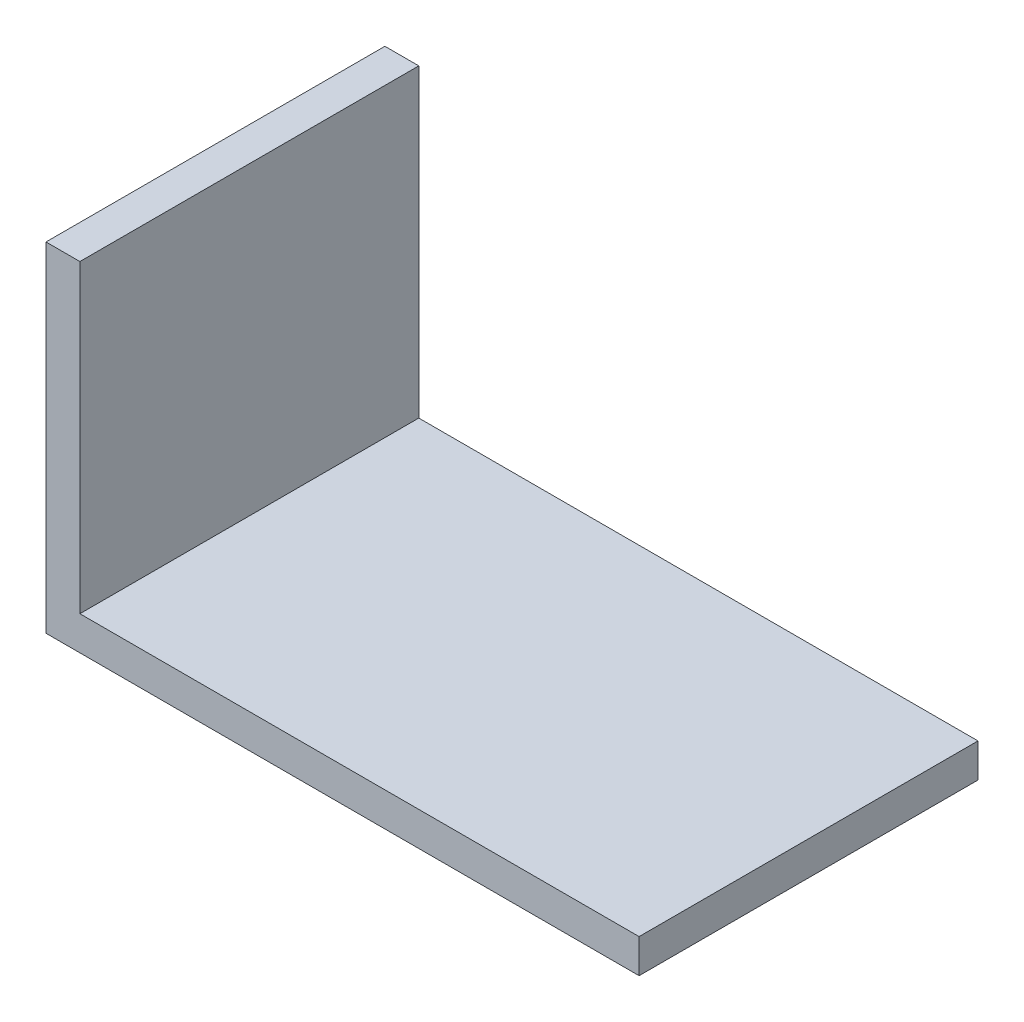
ISO-10303-21;
HEADER;
FILE_DESCRIPTION(('STEP AP214'),'2;1');
FILE_NAME('part.step','',(''),(''),'','','');
FILE_SCHEMA(('AUTOMOTIVE_DESIGN { 1 0 10303 214 1 1 1 1 }'));
ENDSEC;
DATA;
#1=APPLICATION_CONTEXT('core data for automotive mechanical design processes');
#2=APPLICATION_PROTOCOL_DEFINITION('international standard','automotive_design',2000,#1);
#3=PRODUCT_CONTEXT('',#1,'mechanical');
#4=PRODUCT('Part','Part','',(#3));
#5=PRODUCT_RELATED_PRODUCT_CATEGORY('part','',(#4));
#6=PRODUCT_DEFINITION_FORMATION('','',#4);
#7=PRODUCT_DEFINITION_CONTEXT('part definition',#1,'design');
#8=PRODUCT_DEFINITION('design','',#6,#7);
#9=PRODUCT_DEFINITION_SHAPE('','',#8);
#10=(LENGTH_UNIT() NAMED_UNIT(*) SI_UNIT(.MILLI.,.METRE.));
#11=(NAMED_UNIT(*) PLANE_ANGLE_UNIT() SI_UNIT($,.RADIAN.));
#12=(NAMED_UNIT(*) SI_UNIT($,.STERADIAN.) SOLID_ANGLE_UNIT());
#13=UNCERTAINTY_MEASURE_WITH_UNIT(LENGTH_MEASURE(1.E-05),#10,'distance_accuracy_value','');
#14=(GEOMETRIC_REPRESENTATION_CONTEXT(3) GLOBAL_UNCERTAINTY_ASSIGNED_CONTEXT((#13)) GLOBAL_UNIT_ASSIGNED_CONTEXT((#10,
#11,#12)) REPRESENTATION_CONTEXT('',''));
#15=CARTESIAN_POINT('',(0.,0.,0.));
#16=DIRECTION('',(0.,0.,1.));
#17=DIRECTION('',(1.,0.,0.));
#18=AXIS2_PLACEMENT_3D('',#15,#16,#17);
#19=CARTESIAN_POINT('',(0.,20.,20.));
#20=DIRECTION('',(1.,0.,0.));
#21=DIRECTION('',(0.,1.,0.));
#22=AXIS2_PLACEMENT_3D('',#19,#20,#21);
#23=PLANE('',#22);
#24=DIRECTION('',(0.,-1.,0.));
#25=VECTOR('',#24,1.);
#26=CARTESIAN_POINT('',(0.,20.,0.));
#27=LINE('',#26,#25);
#28=CARTESIAN_POINT('',(0.,20.,0.));
#29=VERTEX_POINT('',#28);
#30=CARTESIAN_POINT('',(0.,0.,0.));
#31=VERTEX_POINT('',#30);
#32=EDGE_CURVE('E121',#29,#31,#27,.T.);
#33=ORIENTED_EDGE('',*,*,#32,.T.);
#34=DIRECTION('',(0.,0.,-1.));
#35=VECTOR('',#34,1.);
#36=CARTESIAN_POINT('',(0.,0.,20.));
#37=LINE('',#36,#35);
#38=CARTESIAN_POINT('',(0.,0.,20.));
#39=VERTEX_POINT('',#38);
#40=EDGE_CURVE('E11',#39,#31,#37,.T.);
#41=ORIENTED_EDGE('',*,*,#40,.F.);
#42=DIRECTION('',(0.,-1.,0.));
#43=VECTOR('',#42,1.);
#44=CARTESIAN_POINT('',(0.,20.,20.));
#45=LINE('',#44,#43);
#46=CARTESIAN_POINT('',(0.,20.,20.));
#47=VERTEX_POINT('',#46);
#48=EDGE_CURVE('E131',#47,#39,#45,.T.);
#49=ORIENTED_EDGE('',*,*,#48,.F.);
#50=DIRECTION('',(0.,0.,-1.));
#51=VECTOR('',#50,1.);
#52=CARTESIAN_POINT('',(0.,20.,20.));
#53=LINE('',#52,#51);
#54=EDGE_CURVE('E117',#47,#29,#53,.T.);
#55=ORIENTED_EDGE('',*,*,#54,.T.);
#56=EDGE_LOOP('',(#33,#41,#49,#55));
#57=FACE_BOUND('',#56,.T.);
#58=ADVANCED_FACE('F37',(#57),#23,.F.);
#59=CARTESIAN_POINT('',(0.,0.,20.));
#60=DIRECTION('',(0.,1.,0.));
#61=DIRECTION('',(0.,0.,1.));
#62=AXIS2_PLACEMENT_3D('',#59,#60,#61);
#63=PLANE('',#62);
#64=DIRECTION('',(1.,0.,0.));
#65=VECTOR('',#64,1.);
#66=CARTESIAN_POINT('',(0.,0.,0.));
#67=LINE('',#66,#65);
#68=CARTESIAN_POINT('',(35.,0.,0.));
#69=VERTEX_POINT('',#68);
#70=EDGE_CURVE('E124',#31,#69,#67,.T.);
#71=ORIENTED_EDGE('',*,*,#70,.T.);
#72=DIRECTION('',(0.,0.,-1.));
#73=VECTOR('',#72,1.);
#74=CARTESIAN_POINT('',(35.,0.,20.));
#75=LINE('',#74,#73);
#76=CARTESIAN_POINT('',(35.,0.,20.));
#77=VERTEX_POINT('',#76);
#78=EDGE_CURVE('E45',#77,#69,#75,.T.);
#79=ORIENTED_EDGE('',*,*,#78,.F.);
#80=DIRECTION('',(1.,0.,0.));
#81=VECTOR('',#80,1.);
#82=CARTESIAN_POINT('',(0.,0.,20.));
#83=LINE('',#82,#81);
#84=EDGE_CURVE('E90',#39,#77,#83,.T.);
#85=ORIENTED_EDGE('',*,*,#84,.F.);
#86=ORIENTED_EDGE('',*,*,#40,.T.);
#87=EDGE_LOOP('',(#71,#79,#85,#86));
#88=FACE_BOUND('',#87,.T.);
#89=ADVANCED_FACE('F155',(#88),#63,.F.);
#90=CARTESIAN_POINT('',(35.,0.,20.));
#91=DIRECTION('',(-1.,0.,0.));
#92=DIRECTION('',(0.,0.,1.));
#93=AXIS2_PLACEMENT_3D('',#90,#91,#92);
#94=PLANE('',#93);
#95=DIRECTION('',(0.,1.,0.));
#96=VECTOR('',#95,1.);
#97=CARTESIAN_POINT('',(35.,0.,0.));
#98=LINE('',#97,#96);
#99=CARTESIAN_POINT('',(35.,2.,0.));
#100=VERTEX_POINT('',#99);
#101=EDGE_CURVE('E126',#69,#100,#98,.T.);
#102=ORIENTED_EDGE('',*,*,#101,.T.);
#103=DIRECTION('',(0.,0.,-1.));
#104=VECTOR('',#103,1.);
#105=CARTESIAN_POINT('',(35.,2.,20.));
#106=LINE('',#105,#104);
#107=CARTESIAN_POINT('',(35.,2.,20.));
#108=VERTEX_POINT('',#107);
#109=EDGE_CURVE('E112',#108,#100,#106,.T.);
#110=ORIENTED_EDGE('',*,*,#109,.F.);
#111=DIRECTION('',(0.,1.,0.));
#112=VECTOR('',#111,1.);
#113=CARTESIAN_POINT('',(35.,0.,20.));
#114=LINE('',#113,#112);
#115=EDGE_CURVE('E103',#77,#108,#114,.T.);
#116=ORIENTED_EDGE('',*,*,#115,.F.);
#117=ORIENTED_EDGE('',*,*,#78,.T.);
#118=EDGE_LOOP('',(#102,#110,#116,#117));
#119=FACE_BOUND('',#118,.T.);
#120=ADVANCED_FACE('F137',(#119),#94,.F.);
#121=CARTESIAN_POINT('',(35.,2.,20.));
#122=DIRECTION('',(0.,-1.,0.));
#123=DIRECTION('',(1.,0.,0.));
#124=AXIS2_PLACEMENT_3D('',#121,#122,#123);
#125=PLANE('',#124);
#126=DIRECTION('',(-1.,0.,0.));
#127=VECTOR('',#126,1.);
#128=CARTESIAN_POINT('',(35.,2.,0.));
#129=LINE('',#128,#127);
#130=CARTESIAN_POINT('',(2.,2.,0.));
#131=VERTEX_POINT('',#130);
#132=EDGE_CURVE('E111',#100,#131,#129,.T.);
#133=ORIENTED_EDGE('',*,*,#132,.T.);
#134=DIRECTION('',(0.,0.,-1.));
#135=VECTOR('',#134,1.);
#136=CARTESIAN_POINT('',(2.,2.,20.));
#137=LINE('',#136,#135);
#138=CARTESIAN_POINT('',(2.,2.,20.));
#139=VERTEX_POINT('',#138);
#140=EDGE_CURVE('E108',#139,#131,#137,.T.);
#141=ORIENTED_EDGE('',*,*,#140,.F.);
#142=DIRECTION('',(-1.,0.,0.));
#143=VECTOR('',#142,1.);
#144=CARTESIAN_POINT('',(35.,2.,20.));
#145=LINE('',#144,#143);
#146=EDGE_CURVE('E97',#108,#139,#145,.T.);
#147=ORIENTED_EDGE('',*,*,#146,.F.);
#148=ORIENTED_EDGE('',*,*,#109,.T.);
#149=EDGE_LOOP('',(#133,#141,#147,#148));
#150=FACE_BOUND('',#149,.T.);
#151=ADVANCED_FACE('F109',(#150),#125,.F.);
#152=CARTESIAN_POINT('',(2.,2.,20.));
#153=DIRECTION('',(-1.,0.,0.));
#154=DIRECTION('',(0.,0.,1.));
#155=AXIS2_PLACEMENT_3D('',#152,#153,#154);
#156=PLANE('',#155);
#157=DIRECTION('',(0.,1.,0.));
#158=VECTOR('',#157,1.);
#159=CARTESIAN_POINT('',(2.,2.,0.));
#160=LINE('',#159,#158);
#161=CARTESIAN_POINT('',(2.,20.,0.));
#162=VERTEX_POINT('',#161);
#163=EDGE_CURVE('E76',#131,#162,#160,.T.);
#164=ORIENTED_EDGE('',*,*,#163,.T.);
#165=DIRECTION('',(0.,0.,-1.));
#166=VECTOR('',#165,1.);
#167=CARTESIAN_POINT('',(2.,20.,20.));
#168=LINE('',#167,#166);
#169=CARTESIAN_POINT('',(2.,20.,20.));
#170=VERTEX_POINT('',#169);
#171=EDGE_CURVE('E113',#170,#162,#168,.T.);
#172=ORIENTED_EDGE('',*,*,#171,.F.);
#173=DIRECTION('',(0.,1.,0.));
#174=VECTOR('',#173,1.);
#175=CARTESIAN_POINT('',(2.,2.,20.));
#176=LINE('',#175,#174);
#177=EDGE_CURVE('E101',#139,#170,#176,.T.);
#178=ORIENTED_EDGE('',*,*,#177,.F.);
#179=ORIENTED_EDGE('',*,*,#140,.T.);
#180=EDGE_LOOP('',(#164,#172,#178,#179));
#181=FACE_BOUND('',#180,.T.);
#182=ADVANCED_FACE('F115',(#181),#156,.F.);
#183=CARTESIAN_POINT('',(2.,20.,20.));
#184=DIRECTION('',(0.,-1.,0.));
#185=DIRECTION('',(0.,0.,-1.));
#186=AXIS2_PLACEMENT_3D('',#183,#184,#185);
#187=PLANE('',#186);
#188=DIRECTION('',(-1.,0.,0.));
#189=VECTOR('',#188,1.);
#190=CARTESIAN_POINT('',(2.,20.,0.));
#191=LINE('',#190,#189);
#192=EDGE_CURVE('E82',#162,#29,#191,.T.);
#193=ORIENTED_EDGE('',*,*,#192,.T.);
#194=ORIENTED_EDGE('',*,*,#54,.F.);
#195=DIRECTION('',(-1.,0.,0.));
#196=VECTOR('',#195,1.);
#197=CARTESIAN_POINT('',(2.,20.,20.));
#198=LINE('',#197,#196);
#199=EDGE_CURVE('E53',#170,#47,#198,.T.);
#200=ORIENTED_EDGE('',*,*,#199,.F.);
#201=ORIENTED_EDGE('',*,*,#171,.T.);
#202=EDGE_LOOP('',(#193,#194,#200,#201));
#203=FACE_BOUND('',#202,.T.);
#204=ADVANCED_FACE('F144',(#203),#187,.F.);
#205=CARTESIAN_POINT('',(0.,0.,20.));
#206=DIRECTION('',(0.,0.,1.));
#207=DIRECTION('',(1.,0.,0.));
#208=AXIS2_PLACEMENT_3D('',#205,#206,#207);
#209=PLANE('',#208);
#210=ORIENTED_EDGE('',*,*,#48,.T.);
#211=ORIENTED_EDGE('',*,*,#84,.T.);
#212=ORIENTED_EDGE('',*,*,#115,.T.);
#213=ORIENTED_EDGE('',*,*,#146,.T.);
#214=ORIENTED_EDGE('',*,*,#177,.T.);
#215=ORIENTED_EDGE('',*,*,#199,.T.);
#216=EDGE_LOOP('',(#210,#211,#212,#213,#214,#215));
#217=FACE_BOUND('',#216,.T.);
#218=ADVANCED_FACE('F99',(#217),#209,.T.);
#219=CARTESIAN_POINT('',(0.,0.,0.));
#220=DIRECTION('',(0.,0.,1.));
#221=DIRECTION('',(1.,0.,0.));
#222=AXIS2_PLACEMENT_3D('',#219,#220,#221);
#223=PLANE('',#222);
#224=ORIENTED_EDGE('',*,*,#32,.F.);
#225=ORIENTED_EDGE('',*,*,#192,.F.);
#226=ORIENTED_EDGE('',*,*,#163,.F.);
#227=ORIENTED_EDGE('',*,*,#132,.F.);
#228=ORIENTED_EDGE('',*,*,#101,.F.);
#229=ORIENTED_EDGE('',*,*,#70,.F.);
#230=EDGE_LOOP('',(#224,#225,#226,#227,#228,#229));
#231=FACE_BOUND('',#230,.T.);
#232=ADVANCED_FACE('F140',(#231),#223,.F.);
#233=CLOSED_SHELL('',(#58,#89,#120,#151,#182,#204,#218,#232));
#234=MANIFOLD_SOLID_BREP('B2',#233);
#235=ADVANCED_BREP_SHAPE_REPRESENTATION('',(#18,#234),#14);
#236=SHAPE_DEFINITION_REPRESENTATION(#9,#235);
ENDSEC;
END-ISO-10303-21;
